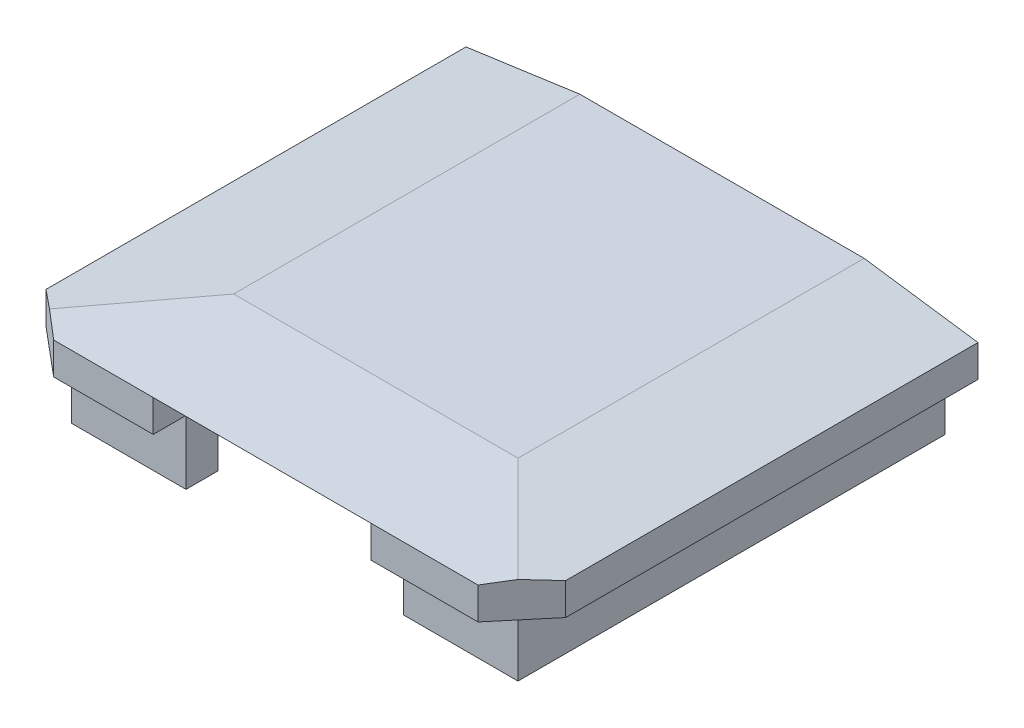
ISO-10303-21;
HEADER;
FILE_DESCRIPTION(('STEP AP214'),'2;1');
FILE_NAME('part.step','',(''),(''),'','','');
FILE_SCHEMA(('AUTOMOTIVE_DESIGN { 1 0 10303 214 1 1 1 1 }'));
ENDSEC;
DATA;
#1=APPLICATION_CONTEXT('core data for automotive mechanical design processes');
#2=APPLICATION_PROTOCOL_DEFINITION('international standard','automotive_design',2000,#1);
#3=PRODUCT_CONTEXT('',#1,'mechanical');
#4=PRODUCT('Part','Part','',(#3));
#5=PRODUCT_RELATED_PRODUCT_CATEGORY('part','',(#4));
#6=PRODUCT_DEFINITION_FORMATION('','',#4);
#7=PRODUCT_DEFINITION_CONTEXT('part definition',#1,'design');
#8=PRODUCT_DEFINITION('design','',#6,#7);
#9=PRODUCT_DEFINITION_SHAPE('','',#8);
#10=(LENGTH_UNIT() NAMED_UNIT(*) SI_UNIT(.MILLI.,.METRE.));
#11=(NAMED_UNIT(*) PLANE_ANGLE_UNIT() SI_UNIT($,.RADIAN.));
#12=(NAMED_UNIT(*) SI_UNIT($,.STERADIAN.) SOLID_ANGLE_UNIT());
#13=UNCERTAINTY_MEASURE_WITH_UNIT(LENGTH_MEASURE(1.E-05),#10,'distance_accuracy_value','');
#14=(GEOMETRIC_REPRESENTATION_CONTEXT(3) GLOBAL_UNCERTAINTY_ASSIGNED_CONTEXT((#13)) GLOBAL_UNIT_ASSIGNED_CONTEXT((#10,
#11,#12)) REPRESENTATION_CONTEXT('',''));
#15=CARTESIAN_POINT('',(0.,0.,0.));
#16=DIRECTION('',(0.,0.,1.));
#17=DIRECTION('',(1.,0.,0.));
#18=AXIS2_PLACEMENT_3D('',#15,#16,#17);
#19=CARTESIAN_POINT('',(0.,0.,0.));
#20=DIRECTION('',(0.,1.,0.));
#21=DIRECTION('',(0.,0.,1.));
#22=AXIS2_PLACEMENT_3D('',#19,#20,#21);
#23=PLANE('',#22);
#24=DIRECTION('',(0.,0.,1.));
#25=VECTOR('',#24,1.);
#26=CARTESIAN_POINT('',(-16.,0.,-24.));
#27=LINE('',#26,#25);
#28=CARTESIAN_POINT('',(-16.,0.,-4.74792761990778));
#29=VERTEX_POINT('',#28);
#30=CARTESIAN_POINT('',(-16.,0.,21.5));
#31=VERTEX_POINT('',#30);
#32=EDGE_CURVE('E279',#29,#31,#27,.T.);
#33=ORIENTED_EDGE('',*,*,#32,.F.);
#34=DIRECTION('',(1.,0.,0.));
#35=VECTOR('',#34,1.);
#36=CARTESIAN_POINT('',(0.,0.,-4.74792761990778));
#37=LINE('',#36,#35);
#38=CARTESIAN_POINT('',(-13.95,0.,-4.74792761990778));
#39=VERTEX_POINT('',#38);
#40=EDGE_CURVE('E407',#29,#39,#37,.T.);
#41=ORIENTED_EDGE('',*,*,#40,.T.);
#42=DIRECTION('',(0.,0.,-1.));
#43=VECTOR('',#42,1.);
#44=CARTESIAN_POINT('',(-13.95,0.,21.95));
#45=LINE('',#44,#43);
#46=CARTESIAN_POINT('',(-13.95,0.,21.95));
#47=VERTEX_POINT('',#46);
#48=EDGE_CURVE('E335',#47,#39,#45,.T.);
#49=ORIENTED_EDGE('',*,*,#48,.F.);
#50=DIRECTION('',(-1.,0.,0.));
#51=VECTOR('',#50,1.);
#52=CARTESIAN_POINT('',(-6.8,0.,21.95));
#53=LINE('',#52,#51);
#54=CARTESIAN_POINT('',(-6.8,0.,21.95));
#55=VERTEX_POINT('',#54);
#56=EDGE_CURVE('E338',#55,#47,#53,.T.);
#57=ORIENTED_EDGE('',*,*,#56,.F.);
#58=DIRECTION('',(0.,0.,1.));
#59=VECTOR('',#58,1.);
#60=CARTESIAN_POINT('',(-6.8,0.,17.));
#61=LINE('',#60,#59);
#62=CARTESIAN_POINT('',(-6.8,0.,24.));
#63=VERTEX_POINT('',#62);
#64=EDGE_CURVE('E275',#55,#63,#61,.T.);
#65=ORIENTED_EDGE('',*,*,#64,.T.);
#66=DIRECTION('',(1.,0.,0.));
#67=VECTOR('',#66,1.);
#68=CARTESIAN_POINT('',(-16.,0.,24.));
#69=LINE('',#68,#67);
#70=CARTESIAN_POINT('',(-13.0206160185145,0.,24.));
#71=VERTEX_POINT('',#70);
#72=EDGE_CURVE('E269',#71,#63,#69,.T.);
#73=ORIENTED_EDGE('',*,*,#72,.F.);
#74=DIRECTION('',(0.766044443118977,0.,0.64278760968654));
#75=VECTOR('',#74,1.);
#76=CARTESIAN_POINT('',(-13.0206160185145,0.,24.));
#77=LINE('',#76,#75);
#78=EDGE_CURVE('E238',#71,#31,#77,.F.);
#79=ORIENTED_EDGE('',*,*,#78,.T.);
#80=EDGE_LOOP('',(#33,#41,#49,#57,#65,#73,#79));
#81=FACE_BOUND('',#80,.T.);
#82=ADVANCED_FACE('F37',(#81),#23,.F.);
#83=DIRECTION('',(0.,0.,1.));
#84=VECTOR('',#83,1.);
#85=CARTESIAN_POINT('',(-11.95,0.,19.95));
#86=LINE('',#85,#84);
#87=CARTESIAN_POINT('',(-11.95,0.,-4.74792761990778));
#88=VERTEX_POINT('',#87);
#89=CARTESIAN_POINT('',(-11.95,0.,19.95));
#90=VERTEX_POINT('',#89);
#91=EDGE_CURVE('E332',#88,#90,#86,.T.);
#92=ORIENTED_EDGE('',*,*,#91,.F.);
#93=CARTESIAN_POINT('',(11.95,0.,-4.74792761990778));
#94=VERTEX_POINT('',#93);
#95=EDGE_CURVE('E398',#88,#94,#37,.T.);
#96=ORIENTED_EDGE('',*,*,#95,.T.);
#97=DIRECTION('',(0.,0.,-1.));
#98=VECTOR('',#97,1.);
#99=CARTESIAN_POINT('',(11.95,0.,-19.95));
#100=LINE('',#99,#98);
#101=CARTESIAN_POINT('',(11.95,0.,19.95));
#102=VERTEX_POINT('',#101);
#103=EDGE_CURVE('E307',#102,#94,#100,.T.);
#104=ORIENTED_EDGE('',*,*,#103,.F.);
#105=DIRECTION('',(1.,0.,0.));
#106=VECTOR('',#105,1.);
#107=CARTESIAN_POINT('',(11.95,0.,19.95));
#108=LINE('',#107,#106);
#109=CARTESIAN_POINT('',(6.8,0.,19.95));
#110=VERTEX_POINT('',#109);
#111=EDGE_CURVE('E298',#110,#102,#108,.T.);
#112=ORIENTED_EDGE('',*,*,#111,.F.);
#113=DIRECTION('',(0.,0.,1.));
#114=VECTOR('',#113,1.);
#115=CARTESIAN_POINT('',(6.8,0.,17.));
#116=LINE('',#115,#114);
#117=CARTESIAN_POINT('',(6.8,0.,17.));
#118=VERTEX_POINT('',#117);
#119=EDGE_CURVE('E358',#118,#110,#116,.T.);
#120=ORIENTED_EDGE('',*,*,#119,.F.);
#121=DIRECTION('',(1.,0.,0.));
#122=VECTOR('',#121,1.);
#123=CARTESIAN_POINT('',(-6.8,0.,17.));
#124=LINE('',#123,#122);
#125=CARTESIAN_POINT('',(-6.8,0.,17.));
#126=VERTEX_POINT('',#125);
#127=EDGE_CURVE('E380',#126,#118,#124,.T.);
#128=ORIENTED_EDGE('',*,*,#127,.F.);
#129=CARTESIAN_POINT('',(-6.8,0.,19.95));
#130=VERTEX_POINT('',#129);
#131=EDGE_CURVE('E355',#126,#130,#61,.T.);
#132=ORIENTED_EDGE('',*,*,#131,.T.);
#133=DIRECTION('',(1.,0.,0.));
#134=VECTOR('',#133,1.);
#135=CARTESIAN_POINT('',(-6.8,0.,19.95));
#136=LINE('',#135,#134);
#137=EDGE_CURVE('E341',#90,#130,#136,.T.);
#138=ORIENTED_EDGE('',*,*,#137,.F.);
#139=EDGE_LOOP('',(#92,#96,#104,#112,#120,#128,#132,#138));
#140=FACE_BOUND('',#139,.T.);
#141=ADVANCED_FACE('F437',(#140),#23,.F.);
#142=CARTESIAN_POINT('',(-16.,3.,24.));
#143=DIRECTION('',(0.,0.,-1.));
#144=DIRECTION('',(-1.,0.,0.));
#145=AXIS2_PLACEMENT_3D('',#142,#143,#144);
#146=PLANE('',#145);
#147=DIRECTION('',(-1.,0.,0.));
#148=VECTOR('',#147,1.);
#149=CARTESIAN_POINT('',(-16.,2.,24.));
#150=LINE('',#149,#148);
#151=CARTESIAN_POINT('',(-6.8,2.,24.));
#152=VERTEX_POINT('',#151);
#153=CARTESIAN_POINT('',(-13.0206160185145,2.,24.));
#154=VERTEX_POINT('',#153);
#155=EDGE_CURVE('E225',#152,#154,#150,.T.);
#156=ORIENTED_EDGE('',*,*,#155,.T.);
#157=DIRECTION('',(0.,-1.,0.));
#158=VECTOR('',#157,1.);
#159=CARTESIAN_POINT('',(-13.0206160185145,3.,24.));
#160=LINE('',#159,#158);
#161=EDGE_CURVE('E252',#154,#71,#160,.T.);
#162=ORIENTED_EDGE('',*,*,#161,.T.);
#163=ORIENTED_EDGE('',*,*,#72,.T.);
#164=DIRECTION('',(0.,-1.,0.));
#165=VECTOR('',#164,1.);
#166=CARTESIAN_POINT('',(-6.8,2.,24.));
#167=LINE('',#166,#165);
#168=EDGE_CURVE('E371',#152,#63,#167,.T.);
#169=ORIENTED_EDGE('',*,*,#168,.F.);
#170=EDGE_LOOP('',(#156,#162,#163,#169));
#171=FACE_BOUND('',#170,.T.);
#172=ADVANCED_FACE('F267',(#171),#146,.F.);
#173=DIRECTION('',(0.,0.,1.));
#174=VECTOR('',#173,1.);
#175=CARTESIAN_POINT('',(13.95,0.,-21.95));
#176=LINE('',#175,#174);
#177=CARTESIAN_POINT('',(13.95,0.,-4.74792761990778));
#178=VERTEX_POINT('',#177);
#179=CARTESIAN_POINT('',(13.95,0.,21.95));
#180=VERTEX_POINT('',#179);
#181=EDGE_CURVE('E305',#178,#180,#176,.T.);
#182=ORIENTED_EDGE('',*,*,#181,.F.);
#183=CARTESIAN_POINT('',(16.,0.,-4.74792761990778));
#184=VERTEX_POINT('',#183);
#185=EDGE_CURVE('E389',#178,#184,#37,.T.);
#186=ORIENTED_EDGE('',*,*,#185,.T.);
#187=DIRECTION('',(0.,0.,-1.));
#188=VECTOR('',#187,1.);
#189=CARTESIAN_POINT('',(16.,0.,-24.));
#190=LINE('',#189,#188);
#191=CARTESIAN_POINT('',(16.,0.,21.0206160185145));
#192=VERTEX_POINT('',#191);
#193=EDGE_CURVE('E282',#192,#184,#190,.T.);
#194=ORIENTED_EDGE('',*,*,#193,.F.);
#195=DIRECTION('',(0.642787609686541,0.,-0.766044443118977));
#196=VECTOR('',#195,1.);
#197=CARTESIAN_POINT('',(16.,0.,21.0206160185145));
#198=LINE('',#197,#196);
#199=CARTESIAN_POINT('',(13.5,0.,24.));
#200=VERTEX_POINT('',#199);
#201=EDGE_CURVE('E241',#192,#200,#198,.F.);
#202=ORIENTED_EDGE('',*,*,#201,.T.);
#203=CARTESIAN_POINT('',(6.8,0.,24.));
#204=VERTEX_POINT('',#203);
#205=EDGE_CURVE('E276',#204,#200,#69,.T.);
#206=ORIENTED_EDGE('',*,*,#205,.F.);
#207=CARTESIAN_POINT('',(6.8,0.,21.95));
#208=VERTEX_POINT('',#207);
#209=EDGE_CURVE('E357',#208,#204,#116,.T.);
#210=ORIENTED_EDGE('',*,*,#209,.F.);
#211=DIRECTION('',(-1.,0.,0.));
#212=VECTOR('',#211,1.);
#213=CARTESIAN_POINT('',(13.95,0.,21.95));
#214=LINE('',#213,#212);
#215=EDGE_CURVE('E302',#180,#208,#214,.T.);
#216=ORIENTED_EDGE('',*,*,#215,.F.);
#217=EDGE_LOOP('',(#182,#186,#194,#202,#206,#210,#216));
#218=FACE_BOUND('',#217,.T.);
#219=ADVANCED_FACE('F461',(#218),#23,.F.);
#220=CARTESIAN_POINT('',(16.,3.,-24.));
#221=DIRECTION('',(-1.,0.,0.));
#222=DIRECTION('',(0.,0.,1.));
#223=AXIS2_PLACEMENT_3D('',#220,#221,#222);
#224=PLANE('',#223);
#225=ORIENTED_EDGE('',*,*,#193,.T.);
#226=DIRECTION('',(0.,1.,0.));
#227=VECTOR('',#226,1.);
#228=CARTESIAN_POINT('',(16.,3.,-4.74792761990778));
#229=LINE('',#228,#227);
#230=CARTESIAN_POINT('',(16.,2.,-4.74792761990778));
#231=VERTEX_POINT('',#230);
#232=EDGE_CURVE('E386',#184,#231,#229,.T.);
#233=ORIENTED_EDGE('',*,*,#232,.T.);
#234=DIRECTION('',(0.,0.,1.));
#235=VECTOR('',#234,1.);
#236=CARTESIAN_POINT('',(16.,2.,16.8846302776158));
#237=LINE('',#236,#235);
#238=CARTESIAN_POINT('',(16.,2.,21.0206160185145));
#239=VERTEX_POINT('',#238);
#240=EDGE_CURVE('E223',#231,#239,#237,.T.);
#241=ORIENTED_EDGE('',*,*,#240,.T.);
#242=DIRECTION('',(0.,-1.,0.));
#243=VECTOR('',#242,1.);
#244=CARTESIAN_POINT('',(16.,3.,21.0206160185145));
#245=LINE('',#244,#243);
#246=EDGE_CURVE('E235',#239,#192,#245,.T.);
#247=ORIENTED_EDGE('',*,*,#246,.T.);
#248=EDGE_LOOP('',(#225,#233,#241,#247));
#249=FACE_BOUND('',#248,.T.);
#250=ADVANCED_FACE('F469',(#249),#224,.F.);
#251=CARTESIAN_POINT('',(-16.,3.,-24.));
#252=DIRECTION('',(1.,0.,0.));
#253=DIRECTION('',(0.,0.,-1.));
#254=AXIS2_PLACEMENT_3D('',#251,#252,#253);
#255=PLANE('',#254);
#256=DIRECTION('',(0.,0.,-1.));
#257=VECTOR('',#256,1.);
#258=CARTESIAN_POINT('',(-16.,2.,-16.8846302776158));
#259=LINE('',#258,#257);
#260=CARTESIAN_POINT('',(-16.,2.,21.5));
#261=VERTEX_POINT('',#260);
#262=CARTESIAN_POINT('',(-16.,2.,-4.74792761990778));
#263=VERTEX_POINT('',#262);
#264=EDGE_CURVE('E233',#261,#263,#259,.T.);
#265=ORIENTED_EDGE('',*,*,#264,.T.);
#266=DIRECTION('',(0.,-1.,0.));
#267=VECTOR('',#266,1.);
#268=CARTESIAN_POINT('',(-16.,3.,-4.74792761990778));
#269=LINE('',#268,#267);
#270=EDGE_CURVE('E52',#263,#29,#269,.T.);
#271=ORIENTED_EDGE('',*,*,#270,.T.);
#272=ORIENTED_EDGE('',*,*,#32,.T.);
#273=DIRECTION('',(0.,1.,0.));
#274=VECTOR('',#273,1.);
#275=CARTESIAN_POINT('',(-16.,3.,21.5));
#276=LINE('',#275,#274);
#277=EDGE_CURVE('E60',#31,#261,#276,.T.);
#278=ORIENTED_EDGE('',*,*,#277,.T.);
#279=EDGE_LOOP('',(#265,#271,#272,#278));
#280=FACE_BOUND('',#279,.T.);
#281=ADVANCED_FACE('F410',(#280),#255,.F.);
#282=ORIENTED_EDGE('',*,*,#205,.T.);
#283=DIRECTION('',(0.,1.,0.));
#284=VECTOR('',#283,1.);
#285=CARTESIAN_POINT('',(13.5,3.,24.));
#286=LINE('',#285,#284);
#287=CARTESIAN_POINT('',(13.5,2.,24.));
#288=VERTEX_POINT('',#287);
#289=EDGE_CURVE('E243',#200,#288,#286,.T.);
#290=ORIENTED_EDGE('',*,*,#289,.T.);
#291=CARTESIAN_POINT('',(6.8,2.,24.));
#292=VERTEX_POINT('',#291);
#293=EDGE_CURVE('E221',#288,#292,#150,.T.);
#294=ORIENTED_EDGE('',*,*,#293,.T.);
#295=DIRECTION('',(0.,1.,0.));
#296=VECTOR('',#295,1.);
#297=CARTESIAN_POINT('',(6.8,0.,24.));
#298=LINE('',#297,#296);
#299=EDGE_CURVE('E368',#204,#292,#298,.T.);
#300=ORIENTED_EDGE('',*,*,#299,.F.);
#301=EDGE_LOOP('',(#282,#290,#294,#300));
#302=FACE_BOUND('',#301,.T.);
#303=ADVANCED_FACE('F458',(#302),#146,.F.);
#304=CARTESIAN_POINT('',(0.,3.,0.));
#305=DIRECTION('',(0.,1.,0.));
#306=DIRECTION('',(0.,0.,1.));
#307=AXIS2_PLACEMENT_3D('',#304,#305,#306);
#308=PLANE('',#307);
#309=DIRECTION('',(1.,0.,0.));
#310=VECTOR('',#309,1.);
#311=CARTESIAN_POINT('',(-21.6753217430571,3.,-4.74792761990778));
#312=LINE('',#311,#310);
#313=CARTESIAN_POINT('',(-8.88463027761579,3.,-4.74792761990778));
#314=VERTEX_POINT('',#313);
#315=CARTESIAN_POINT('',(8.88463027761578,3.,-4.74792761990778));
#316=VERTEX_POINT('',#315);
#317=EDGE_CURVE('E204',#314,#316,#312,.T.);
#318=ORIENTED_EDGE('',*,*,#317,.F.);
#319=DIRECTION('',(0.,0.,1.));
#320=VECTOR('',#319,1.);
#321=CARTESIAN_POINT('',(-8.88463027761579,3.,16.8846302776158));
#322=LINE('',#321,#320);
#323=CARTESIAN_POINT('',(-8.88463027761579,3.,16.8846302776158));
#324=VERTEX_POINT('',#323);
#325=EDGE_CURVE('E212',#314,#324,#322,.T.);
#326=ORIENTED_EDGE('',*,*,#325,.T.);
#327=DIRECTION('',(1.,0.,0.));
#328=VECTOR('',#327,1.);
#329=CARTESIAN_POINT('',(16.,3.,16.8846302776158));
#330=LINE('',#329,#328);
#331=CARTESIAN_POINT('',(8.88463027761578,3.,16.8846302776158));
#332=VERTEX_POINT('',#331);
#333=EDGE_CURVE('E263',#324,#332,#330,.T.);
#334=ORIENTED_EDGE('',*,*,#333,.T.);
#335=DIRECTION('',(0.,0.,-1.));
#336=VECTOR('',#335,1.);
#337=CARTESIAN_POINT('',(8.88463027761578,3.,-16.8846302776158));
#338=LINE('',#337,#336);
#339=EDGE_CURVE('E215',#332,#316,#338,.T.);
#340=ORIENTED_EDGE('',*,*,#339,.T.);
#341=EDGE_LOOP('',(#318,#326,#334,#340));
#342=FACE_BOUND('',#341,.T.);
#343=ADVANCED_FACE('F210',(#342),#308,.T.);
#344=CARTESIAN_POINT('',(11.95,-4.,-19.95));
#345=DIRECTION('',(1.,0.,0.));
#346=DIRECTION('',(0.,0.,-1.));
#347=AXIS2_PLACEMENT_3D('',#344,#345,#346);
#348=PLANE('',#347);
#349=ORIENTED_EDGE('',*,*,#103,.T.);
#350=DIRECTION('',(0.,-1.,0.));
#351=VECTOR('',#350,1.);
#352=CARTESIAN_POINT('',(11.95,-4.,-4.74792761990778));
#353=LINE('',#352,#351);
#354=CARTESIAN_POINT('',(11.95,-4.,-4.74792761990778));
#355=VERTEX_POINT('',#354);
#356=EDGE_CURVE('E395',#94,#355,#353,.T.);
#357=ORIENTED_EDGE('',*,*,#356,.T.);
#358=DIRECTION('',(0.,0.,-1.));
#359=VECTOR('',#358,1.);
#360=CARTESIAN_POINT('',(11.95,-4.,-19.95));
#361=LINE('',#360,#359);
#362=CARTESIAN_POINT('',(11.95,-4.,19.95));
#363=VERTEX_POINT('',#362);
#364=EDGE_CURVE('E301',#363,#355,#361,.T.);
#365=ORIENTED_EDGE('',*,*,#364,.F.);
#366=DIRECTION('',(0.,1.,0.));
#367=VECTOR('',#366,1.);
#368=CARTESIAN_POINT('',(11.95,-4.,19.95));
#369=LINE('',#368,#367);
#370=EDGE_CURVE('E294',#363,#102,#369,.T.);
#371=ORIENTED_EDGE('',*,*,#370,.T.);
#372=EDGE_LOOP('',(#349,#357,#365,#371));
#373=FACE_BOUND('',#372,.T.);
#374=ADVANCED_FACE('F477',(#373),#348,.F.);
#375=CARTESIAN_POINT('',(13.95,-4.,-21.95));
#376=DIRECTION('',(-1.,0.,0.));
#377=DIRECTION('',(0.,0.,1.));
#378=AXIS2_PLACEMENT_3D('',#375,#376,#377);
#379=PLANE('',#378);
#380=DIRECTION('',(0.,0.,1.));
#381=VECTOR('',#380,1.);
#382=CARTESIAN_POINT('',(13.95,-4.,-21.95));
#383=LINE('',#382,#381);
#384=CARTESIAN_POINT('',(13.95,-4.,-4.74792761990778));
#385=VERTEX_POINT('',#384);
#386=CARTESIAN_POINT('',(13.95,-4.,21.95));
#387=VERTEX_POINT('',#386);
#388=EDGE_CURVE('E316',#385,#387,#383,.T.);
#389=ORIENTED_EDGE('',*,*,#388,.F.);
#390=DIRECTION('',(0.,1.,0.));
#391=VECTOR('',#390,1.);
#392=CARTESIAN_POINT('',(13.95,-4.,-4.74792761990778));
#393=LINE('',#392,#391);
#394=EDGE_CURVE('E390',#385,#178,#393,.T.);
#395=ORIENTED_EDGE('',*,*,#394,.T.);
#396=ORIENTED_EDGE('',*,*,#181,.T.);
#397=DIRECTION('',(0.,1.,0.));
#398=VECTOR('',#397,1.);
#399=CARTESIAN_POINT('',(13.95,-4.,21.95));
#400=LINE('',#399,#398);
#401=EDGE_CURVE('E285',#387,#180,#400,.T.);
#402=ORIENTED_EDGE('',*,*,#401,.F.);
#403=EDGE_LOOP('',(#389,#395,#396,#402));
#404=FACE_BOUND('',#403,.T.);
#405=ADVANCED_FACE('F479',(#404),#379,.F.);
#406=CARTESIAN_POINT('',(13.95,-4.,21.95));
#407=DIRECTION('',(0.,0.,-1.));
#408=DIRECTION('',(-1.,0.,0.));
#409=AXIS2_PLACEMENT_3D('',#406,#407,#408);
#410=PLANE('',#409);
#411=ORIENTED_EDGE('',*,*,#215,.T.);
#412=DIRECTION('',(0.,1.,0.));
#413=VECTOR('',#412,1.);
#414=CARTESIAN_POINT('',(6.8,-4.,21.95));
#415=LINE('',#414,#413);
#416=CARTESIAN_POINT('',(6.8,-4.,21.95));
#417=VERTEX_POINT('',#416);
#418=EDGE_CURVE('E288',#417,#208,#415,.T.);
#419=ORIENTED_EDGE('',*,*,#418,.F.);
#420=DIRECTION('',(-1.,0.,0.));
#421=VECTOR('',#420,1.);
#422=CARTESIAN_POINT('',(13.95,-4.,21.95));
#423=LINE('',#422,#421);
#424=EDGE_CURVE('E314',#387,#417,#423,.T.);
#425=ORIENTED_EDGE('',*,*,#424,.F.);
#426=ORIENTED_EDGE('',*,*,#401,.T.);
#427=EDGE_LOOP('',(#411,#419,#425,#426));
#428=FACE_BOUND('',#427,.T.);
#429=ADVANCED_FACE('F453',(#428),#410,.F.);
#430=CARTESIAN_POINT('',(6.8,-4.,21.95));
#431=DIRECTION('',(1.,0.,0.));
#432=DIRECTION('',(0.,0.,-1.));
#433=AXIS2_PLACEMENT_3D('',#430,#431,#432);
#434=PLANE('',#433);
#435=ORIENTED_EDGE('',*,*,#418,.T.);
#436=ORIENTED_EDGE('',*,*,#209,.T.);
#437=ORIENTED_EDGE('',*,*,#299,.T.);
#438=DIRECTION('',(0.,0.,1.));
#439=VECTOR('',#438,1.);
#440=CARTESIAN_POINT('',(6.8,2.,17.));
#441=LINE('',#440,#439);
#442=CARTESIAN_POINT('',(6.8,2.,17.));
#443=VERTEX_POINT('',#442);
#444=EDGE_CURVE('E360',#443,#292,#441,.T.);
#445=ORIENTED_EDGE('',*,*,#444,.F.);
#446=DIRECTION('',(0.,1.,0.));
#447=VECTOR('',#446,1.);
#448=CARTESIAN_POINT('',(6.8,0.,17.));
#449=LINE('',#448,#447);
#450=EDGE_CURVE('E377',#118,#443,#449,.T.);
#451=ORIENTED_EDGE('',*,*,#450,.F.);
#452=ORIENTED_EDGE('',*,*,#119,.T.);
#453=DIRECTION('',(0.,1.,0.));
#454=VECTOR('',#453,1.);
#455=CARTESIAN_POINT('',(6.8,-4.,19.95));
#456=LINE('',#455,#454);
#457=CARTESIAN_POINT('',(6.8,-4.,19.95));
#458=VERTEX_POINT('',#457);
#459=EDGE_CURVE('E291',#458,#110,#456,.T.);
#460=ORIENTED_EDGE('',*,*,#459,.F.);
#461=DIRECTION('',(0.,0.,-1.));
#462=VECTOR('',#461,1.);
#463=CARTESIAN_POINT('',(6.8,-4.,21.95));
#464=LINE('',#463,#462);
#465=EDGE_CURVE('E312',#417,#458,#464,.T.);
#466=ORIENTED_EDGE('',*,*,#465,.F.);
#467=EDGE_LOOP('',(#435,#436,#437,#445,#451,#452,#460,#466));
#468=FACE_BOUND('',#467,.T.);
#469=ADVANCED_FACE('F428',(#468),#434,.F.);
#470=CARTESIAN_POINT('',(11.95,-4.,19.95));
#471=DIRECTION('',(0.,0.,1.));
#472=DIRECTION('',(1.,0.,0.));
#473=AXIS2_PLACEMENT_3D('',#470,#471,#472);
#474=PLANE('',#473);
#475=ORIENTED_EDGE('',*,*,#111,.T.);
#476=ORIENTED_EDGE('',*,*,#370,.F.);
#477=DIRECTION('',(1.,0.,0.));
#478=VECTOR('',#477,1.);
#479=CARTESIAN_POINT('',(11.95,-4.,19.95));
#480=LINE('',#479,#478);
#481=EDGE_CURVE('E297',#458,#363,#480,.T.);
#482=ORIENTED_EDGE('',*,*,#481,.F.);
#483=ORIENTED_EDGE('',*,*,#459,.T.);
#484=EDGE_LOOP('',(#475,#476,#482,#483));
#485=FACE_BOUND('',#484,.T.);
#486=ADVANCED_FACE('F443',(#485),#474,.F.);
#487=CARTESIAN_POINT('',(0.,-4.,0.));
#488=DIRECTION('',(0.,-1.,0.));
#489=DIRECTION('',(0.,0.,-1.));
#490=AXIS2_PLACEMENT_3D('',#487,#488,#489);
#491=PLANE('',#490);
#492=DIRECTION('',(-1.,0.,0.));
#493=VECTOR('',#492,1.);
#494=CARTESIAN_POINT('',(0.,-4.,-4.74792761990778));
#495=LINE('',#494,#493);
#496=EDGE_CURVE('E393',#385,#355,#495,.T.);
#497=ORIENTED_EDGE('',*,*,#496,.F.);
#498=ORIENTED_EDGE('',*,*,#388,.T.);
#499=ORIENTED_EDGE('',*,*,#424,.T.);
#500=ORIENTED_EDGE('',*,*,#465,.T.);
#501=ORIENTED_EDGE('',*,*,#481,.T.);
#502=ORIENTED_EDGE('',*,*,#364,.T.);
#503=EDGE_LOOP('',(#497,#498,#499,#500,#501,#502));
#504=FACE_BOUND('',#503,.T.);
#505=ADVANCED_FACE('F447',(#504),#491,.T.);
#506=CARTESIAN_POINT('',(-6.8,-4.,19.95));
#507=DIRECTION('',(0.,0.,1.));
#508=DIRECTION('',(1.,0.,0.));
#509=AXIS2_PLACEMENT_3D('',#506,#507,#508);
#510=PLANE('',#509);
#511=ORIENTED_EDGE('',*,*,#137,.T.);
#512=DIRECTION('',(0.,1.,0.));
#513=VECTOR('',#512,1.);
#514=CARTESIAN_POINT('',(-6.8,-4.,19.95));
#515=LINE('',#514,#513);
#516=CARTESIAN_POINT('',(-6.8,-4.,19.95));
#517=VERTEX_POINT('',#516);
#518=EDGE_CURVE('E310',#517,#130,#515,.T.);
#519=ORIENTED_EDGE('',*,*,#518,.F.);
#520=DIRECTION('',(1.,0.,0.));
#521=VECTOR('',#520,1.);
#522=CARTESIAN_POINT('',(-6.8,-4.,19.95));
#523=LINE('',#522,#521);
#524=CARTESIAN_POINT('',(-11.95,-4.,19.95));
#525=VERTEX_POINT('',#524);
#526=EDGE_CURVE('E334',#525,#517,#523,.T.);
#527=ORIENTED_EDGE('',*,*,#526,.F.);
#528=DIRECTION('',(0.,1.,0.));
#529=VECTOR('',#528,1.);
#530=CARTESIAN_POINT('',(-11.95,-4.,19.95));
#531=LINE('',#530,#529);
#532=EDGE_CURVE('E328',#525,#90,#531,.T.);
#533=ORIENTED_EDGE('',*,*,#532,.T.);
#534=EDGE_LOOP('',(#511,#519,#527,#533));
#535=FACE_BOUND('',#534,.T.);
#536=ADVANCED_FACE('F558',(#535),#510,.F.);
#537=CARTESIAN_POINT('',(-6.8,-4.,21.95));
#538=DIRECTION('',(-1.,0.,0.));
#539=DIRECTION('',(0.,0.,1.));
#540=AXIS2_PLACEMENT_3D('',#537,#538,#539);
#541=PLANE('',#540);
#542=ORIENTED_EDGE('',*,*,#518,.T.);
#543=ORIENTED_EDGE('',*,*,#131,.F.);
#544=DIRECTION('',(0.,-1.,0.));
#545=VECTOR('',#544,1.);
#546=CARTESIAN_POINT('',(-6.8,2.,17.));
#547=LINE('',#546,#545);
#548=CARTESIAN_POINT('',(-6.8,2.,17.));
#549=VERTEX_POINT('',#548);
#550=EDGE_CURVE('E367',#549,#126,#547,.T.);
#551=ORIENTED_EDGE('',*,*,#550,.F.);
#552=DIRECTION('',(0.,0.,1.));
#553=VECTOR('',#552,1.);
#554=CARTESIAN_POINT('',(-6.8,2.,17.));
#555=LINE('',#554,#553);
#556=EDGE_CURVE('E344',#549,#152,#555,.T.);
#557=ORIENTED_EDGE('',*,*,#556,.T.);
#558=ORIENTED_EDGE('',*,*,#168,.T.);
#559=ORIENTED_EDGE('',*,*,#64,.F.);
#560=DIRECTION('',(0.,1.,0.));
#561=VECTOR('',#560,1.);
#562=CARTESIAN_POINT('',(-6.8,-4.,21.95));
#563=LINE('',#562,#561);
#564=CARTESIAN_POINT('',(-6.8,-4.,21.95));
#565=VERTEX_POINT('',#564);
#566=EDGE_CURVE('E322',#565,#55,#563,.T.);
#567=ORIENTED_EDGE('',*,*,#566,.F.);
#568=DIRECTION('',(0.,0.,1.));
#569=VECTOR('',#568,1.);
#570=CARTESIAN_POINT('',(-6.8,-4.,21.95));
#571=LINE('',#570,#569);
#572=EDGE_CURVE('E351',#517,#565,#571,.T.);
#573=ORIENTED_EDGE('',*,*,#572,.F.);
#574=EDGE_LOOP('',(#542,#543,#551,#557,#558,#559,#567,#573));
#575=FACE_BOUND('',#574,.T.);
#576=ADVANCED_FACE('F420',(#575),#541,.F.);
#577=CARTESIAN_POINT('',(-6.8,-4.,21.95));
#578=DIRECTION('',(0.,0.,-1.));
#579=DIRECTION('',(-1.,0.,0.));
#580=AXIS2_PLACEMENT_3D('',#577,#578,#579);
#581=PLANE('',#580);
#582=ORIENTED_EDGE('',*,*,#56,.T.);
#583=DIRECTION('',(0.,1.,0.));
#584=VECTOR('',#583,1.);
#585=CARTESIAN_POINT('',(-13.95,-4.,21.95));
#586=LINE('',#585,#584);
#587=CARTESIAN_POINT('',(-13.95,-4.,21.95));
#588=VERTEX_POINT('',#587);
#589=EDGE_CURVE('E325',#588,#47,#586,.T.);
#590=ORIENTED_EDGE('',*,*,#589,.F.);
#591=DIRECTION('',(-1.,0.,0.));
#592=VECTOR('',#591,1.);
#593=CARTESIAN_POINT('',(-6.8,-4.,21.95));
#594=LINE('',#593,#592);
#595=EDGE_CURVE('E349',#565,#588,#594,.T.);
#596=ORIENTED_EDGE('',*,*,#595,.F.);
#597=ORIENTED_EDGE('',*,*,#566,.T.);
#598=EDGE_LOOP('',(#582,#590,#596,#597));
#599=FACE_BOUND('',#598,.T.);
#600=ADVANCED_FACE('F417',(#599),#581,.F.);
#601=CARTESIAN_POINT('',(-13.95,-4.,21.95));
#602=DIRECTION('',(1.,0.,0.));
#603=DIRECTION('',(0.,0.,-1.));
#604=AXIS2_PLACEMENT_3D('',#601,#602,#603);
#605=PLANE('',#604);
#606=ORIENTED_EDGE('',*,*,#48,.T.);
#607=DIRECTION('',(0.,-1.,0.));
#608=VECTOR('',#607,1.);
#609=CARTESIAN_POINT('',(-13.95,-4.,-4.74792761990778));
#610=LINE('',#609,#608);
#611=CARTESIAN_POINT('',(-13.95,-4.,-4.74792761990778));
#612=VERTEX_POINT('',#611);
#613=EDGE_CURVE('E404',#39,#612,#610,.T.);
#614=ORIENTED_EDGE('',*,*,#613,.T.);
#615=DIRECTION('',(0.,0.,-1.));
#616=VECTOR('',#615,1.);
#617=CARTESIAN_POINT('',(-13.95,-4.,21.95));
#618=LINE('',#617,#616);
#619=EDGE_CURVE('E346',#588,#612,#618,.T.);
#620=ORIENTED_EDGE('',*,*,#619,.F.);
#621=ORIENTED_EDGE('',*,*,#589,.T.);
#622=EDGE_LOOP('',(#606,#614,#620,#621));
#623=FACE_BOUND('',#622,.T.);
#624=ADVANCED_FACE('F412',(#623),#605,.F.);
#625=CARTESIAN_POINT('',(-11.95,-4.,19.95));
#626=DIRECTION('',(-1.,0.,0.));
#627=DIRECTION('',(0.,0.,1.));
#628=AXIS2_PLACEMENT_3D('',#625,#626,#627);
#629=PLANE('',#628);
#630=DIRECTION('',(0.,0.,1.));
#631=VECTOR('',#630,1.);
#632=CARTESIAN_POINT('',(-11.95,-4.,-21.95));
#633=LINE('',#632,#631);
#634=CARTESIAN_POINT('',(-11.95,-4.,-4.74792761990778));
#635=VERTEX_POINT('',#634);
#636=EDGE_CURVE('E331',#635,#525,#633,.T.);
#637=ORIENTED_EDGE('',*,*,#636,.F.);
#638=DIRECTION('',(0.,1.,0.));
#639=VECTOR('',#638,1.);
#640=CARTESIAN_POINT('',(-11.95,-4.,-4.74792761990778));
#641=LINE('',#640,#639);
#642=EDGE_CURVE('E399',#635,#88,#641,.T.);
#643=ORIENTED_EDGE('',*,*,#642,.T.);
#644=ORIENTED_EDGE('',*,*,#91,.T.);
#645=ORIENTED_EDGE('',*,*,#532,.F.);
#646=EDGE_LOOP('',(#637,#643,#644,#645));
#647=FACE_BOUND('',#646,.T.);
#648=ADVANCED_FACE('F547',(#647),#629,.F.);
#649=CARTESIAN_POINT('',(0.,-4.,0.));
#650=DIRECTION('',(0.,-1.,0.));
#651=DIRECTION('',(0.,0.,-1.));
#652=AXIS2_PLACEMENT_3D('',#649,#650,#651);
#653=PLANE('',#652);
#654=DIRECTION('',(-1.,0.,0.));
#655=VECTOR('',#654,1.);
#656=CARTESIAN_POINT('',(0.,-4.,-4.74792761990778));
#657=LINE('',#656,#655);
#658=EDGE_CURVE('E402',#635,#612,#657,.T.);
#659=ORIENTED_EDGE('',*,*,#658,.F.);
#660=ORIENTED_EDGE('',*,*,#636,.T.);
#661=ORIENTED_EDGE('',*,*,#526,.T.);
#662=ORIENTED_EDGE('',*,*,#572,.T.);
#663=ORIENTED_EDGE('',*,*,#595,.T.);
#664=ORIENTED_EDGE('',*,*,#619,.T.);
#665=EDGE_LOOP('',(#659,#660,#661,#662,#663,#664));
#666=FACE_BOUND('',#665,.T.);
#667=ADVANCED_FACE('F521',(#666),#653,.T.);
#668=CARTESIAN_POINT('',(0.,3.,16.8846302776158));
#669=DIRECTION('',(0.,0.99026806874157,0.139173100960066));
#670=DIRECTION('',(-1.,0.,0.));
#671=AXIS2_PLACEMENT_3D('',#668,#669,#670);
#672=PLANE('',#671);
#673=ORIENTED_EDGE('',*,*,#293,.F.);
#674=DIRECTION('',(-0.639094475910372,-0.107041962313954,0.761643137673297));
#675=VECTOR('',#674,1.);
#676=CARTESIAN_POINT('',(11.5179373545383,1.66802423898722,26.3621302784758));
#677=LINE('',#676,#675);
#678=CARTESIAN_POINT('',(14.6406391705926,2.19104570562665,22.6406391705926));
#679=VERTEX_POINT('',#678);
#680=EDGE_CURVE('E247',#288,#679,#677,.F.);
#681=ORIENTED_EDGE('',*,*,#680,.T.);
#682=DIRECTION('',(-0.703640787534026,0.0988902636106803,-0.703640787534026));
#683=VECTOR('',#682,1.);
#684=CARTESIAN_POINT('',(4.48575780122058,3.61822120958196,12.4857578012206));
#685=LINE('',#684,#683);
#686=EDGE_CURVE('E231',#679,#332,#685,.T.);
#687=ORIENTED_EDGE('',*,*,#686,.T.);
#688=ORIENTED_EDGE('',*,*,#333,.F.);
#689=DIRECTION('',(-0.703640787534027,-0.0988902636106803,0.703640787534026));
#690=VECTOR('',#689,1.);
#691=CARTESIAN_POINT('',(-4.48575780122058,3.61822120958196,12.4857578012206));
#692=LINE('',#691,#690);
#693=CARTESIAN_POINT('',(-14.6406391705926,2.19104570562665,22.6406391705926));
#694=VERTEX_POINT('',#693);
#695=EDGE_CURVE('E219',#324,#694,#692,.T.);
#696=ORIENTED_EDGE('',*,*,#695,.T.);
#697=DIRECTION('',(-0.762937625743273,0.0899715271798894,-0.640180680372452));
#698=VECTOR('',#697,1.);
#699=CARTESIAN_POINT('',(-8.98557310621695,1.52415641750252,27.3858030194934));
#700=LINE('',#699,#698);
#701=EDGE_CURVE('E245',#694,#154,#700,.F.);
#702=ORIENTED_EDGE('',*,*,#701,.T.);
#703=ORIENTED_EDGE('',*,*,#155,.F.);
#704=DIRECTION('',(-1.,0.,0.));
#705=VECTOR('',#704,1.);
#706=CARTESIAN_POINT('',(6.8,2.,24.));
#707=LINE('',#706,#705);
#708=EDGE_CURVE('E364',#292,#152,#707,.T.);
#709=ORIENTED_EDGE('',*,*,#708,.F.);
#710=EDGE_LOOP('',(#673,#681,#687,#688,#696,#702,#703,#709));
#711=FACE_BOUND('',#710,.T.);
#712=ADVANCED_FACE('F260',(#711),#672,.T.);
#713=CARTESIAN_POINT('',(8.88463027761578,3.,0.));
#714=DIRECTION('',(0.139173100960066,0.99026806874157,0.));
#715=DIRECTION('',(0.,0.,1.));
#716=AXIS2_PLACEMENT_3D('',#713,#714,#715);
#717=PLANE('',#716);
#718=DIRECTION('',(0.99026806874157,-0.139173100960066,0.));
#719=VECTOR('',#718,1.);
#720=CARTESIAN_POINT('',(8.88463027761578,3.,-4.74792761990778));
#721=LINE('',#720,#719);
#722=EDGE_CURVE('E373',#316,#231,#721,.T.);
#723=ORIENTED_EDGE('',*,*,#722,.F.);
#724=ORIENTED_EDGE('',*,*,#339,.F.);
#725=ORIENTED_EDGE('',*,*,#686,.F.);
#726=DIRECTION('',(-0.640180680372452,0.0899715271798895,0.762937625743273));
#727=VECTOR('',#726,1.);
#728=CARTESIAN_POINT('',(23.2931464461339,0.975015110853554,12.3289825400187));
#729=LINE('',#728,#727);
#730=EDGE_CURVE('E249',#679,#239,#729,.F.);
#731=ORIENTED_EDGE('',*,*,#730,.T.);
#732=ORIENTED_EDGE('',*,*,#240,.F.);
#733=EDGE_LOOP('',(#723,#724,#725,#731,#732));
#734=FACE_BOUND('',#733,.T.);
#735=ADVANCED_FACE('F473',(#734),#717,.T.);
#736=CARTESIAN_POINT('',(-8.88463027761579,3.,0.));
#737=DIRECTION('',(-0.139173100960066,0.99026806874157,0.));
#738=DIRECTION('',(0.,0.,-1.));
#739=AXIS2_PLACEMENT_3D('',#736,#737,#738);
#740=PLANE('',#739);
#741=DIRECTION('',(0.99026806874157,0.139173100960066,0.));
#742=VECTOR('',#741,1.);
#743=CARTESIAN_POINT('',(-8.88463027761579,3.,-4.74792761990778));
#744=LINE('',#743,#742);
#745=EDGE_CURVE('E11',#263,#314,#744,.T.);
#746=ORIENTED_EDGE('',*,*,#745,.F.);
#747=ORIENTED_EDGE('',*,*,#264,.F.);
#748=DIRECTION('',(-0.761643137673297,-0.107041962313954,-0.639094475910372));
#749=VECTOR('',#748,1.);
#750=CARTESIAN_POINT('',(-22.2562256536922,1.12074482454359,16.250403361425));
#751=LINE('',#750,#749);
#752=EDGE_CURVE('E46',#261,#694,#751,.F.);
#753=ORIENTED_EDGE('',*,*,#752,.T.);
#754=ORIENTED_EDGE('',*,*,#695,.F.);
#755=ORIENTED_EDGE('',*,*,#325,.F.);
#756=EDGE_LOOP('',(#746,#747,#753,#754,#755));
#757=FACE_BOUND('',#756,.T.);
#758=ADVANCED_FACE('F217',(#757),#740,.T.);
#759=CARTESIAN_POINT('',(6.8,2.,17.));
#760=DIRECTION('',(0.,1.,0.));
#761=DIRECTION('',(-1.,0.,0.));
#762=AXIS2_PLACEMENT_3D('',#759,#760,#761);
#763=PLANE('',#762);
#764=ORIENTED_EDGE('',*,*,#708,.T.);
#765=ORIENTED_EDGE('',*,*,#556,.F.);
#766=DIRECTION('',(-1.,0.,0.));
#767=VECTOR('',#766,1.);
#768=CARTESIAN_POINT('',(6.8,2.,17.));
#769=LINE('',#768,#767);
#770=EDGE_CURVE('E374',#443,#549,#769,.T.);
#771=ORIENTED_EDGE('',*,*,#770,.F.);
#772=ORIENTED_EDGE('',*,*,#444,.T.);
#773=EDGE_LOOP('',(#764,#765,#771,#772));
#774=FACE_BOUND('',#773,.T.);
#775=ADVANCED_FACE('F425',(#774),#763,.F.);
#776=CARTESIAN_POINT('',(0.,0.,17.));
#777=DIRECTION('',(0.,0.,1.));
#778=DIRECTION('',(1.,0.,0.));
#779=AXIS2_PLACEMENT_3D('',#776,#777,#778);
#780=PLANE('',#779);
#781=ORIENTED_EDGE('',*,*,#550,.T.);
#782=ORIENTED_EDGE('',*,*,#127,.T.);
#783=ORIENTED_EDGE('',*,*,#450,.T.);
#784=ORIENTED_EDGE('',*,*,#770,.T.);
#785=EDGE_LOOP('',(#781,#782,#783,#784));
#786=FACE_BOUND('',#785,.T.);
#787=ADVANCED_FACE('F431',(#786),#780,.T.);
#788=CARTESIAN_POINT('',(16.,3.,21.0206160185145));
#789=DIRECTION('',(-0.766044443118977,0.,-0.642787609686541));
#790=DIRECTION('',(0.,-1.,0.));
#791=AXIS2_PLACEMENT_3D('',#788,#789,#790);
#792=PLANE('',#791);
#793=ORIENTED_EDGE('',*,*,#680,.F.);
#794=ORIENTED_EDGE('',*,*,#289,.F.);
#795=ORIENTED_EDGE('',*,*,#201,.F.);
#796=ORIENTED_EDGE('',*,*,#246,.F.);
#797=ORIENTED_EDGE('',*,*,#730,.F.);
#798=EDGE_LOOP('',(#793,#794,#795,#796,#797));
#799=FACE_BOUND('',#798,.T.);
#800=ADVANCED_FACE('F466',(#799),#792,.F.);
#801=CARTESIAN_POINT('',(-13.0206160185145,3.,24.));
#802=DIRECTION('',(0.64278760968654,0.,-0.766044443118977));
#803=DIRECTION('',(0.,-1.,0.));
#804=AXIS2_PLACEMENT_3D('',#801,#802,#803);
#805=PLANE('',#804);
#806=ORIENTED_EDGE('',*,*,#752,.F.);
#807=ORIENTED_EDGE('',*,*,#277,.F.);
#808=ORIENTED_EDGE('',*,*,#78,.F.);
#809=ORIENTED_EDGE('',*,*,#161,.F.);
#810=ORIENTED_EDGE('',*,*,#701,.F.);
#811=EDGE_LOOP('',(#806,#807,#808,#809,#810));
#812=FACE_BOUND('',#811,.T.);
#813=ADVANCED_FACE('F40',(#812),#805,.F.);
#814=CARTESIAN_POINT('',(-21.6753217430571,-7.,-4.74792761990778));
#815=DIRECTION('',(0.,0.,1.));
#816=DIRECTION('',(1.,0.,0.));
#817=AXIS2_PLACEMENT_3D('',#814,#815,#816);
#818=PLANE('',#817);
#819=ORIENTED_EDGE('',*,*,#722,.T.);
#820=ORIENTED_EDGE('',*,*,#232,.F.);
#821=ORIENTED_EDGE('',*,*,#185,.F.);
#822=ORIENTED_EDGE('',*,*,#394,.F.);
#823=ORIENTED_EDGE('',*,*,#496,.T.);
#824=ORIENTED_EDGE('',*,*,#356,.F.);
#825=ORIENTED_EDGE('',*,*,#95,.F.);
#826=ORIENTED_EDGE('',*,*,#642,.F.);
#827=ORIENTED_EDGE('',*,*,#658,.T.);
#828=ORIENTED_EDGE('',*,*,#613,.F.);
#829=ORIENTED_EDGE('',*,*,#40,.F.);
#830=ORIENTED_EDGE('',*,*,#270,.F.);
#831=ORIENTED_EDGE('',*,*,#745,.T.);
#832=ORIENTED_EDGE('',*,*,#317,.T.);
#833=EDGE_LOOP('',(#819,#820,#821,#822,#823,#824,#825,#826,#827,#828,#829,#830,#831,#832));
#834=FACE_BOUND('',#833,.T.);
#835=ADVANCED_FACE('F203',(#834),#818,.F.);
#836=CLOSED_SHELL('',(#82,#141,#172,#219,#250,#281,#303,#343,#374,#405,#429,#469,#486,#505,#536,
#576,#600,#624,#648,#667,#712,#735,#758,#775,#787,#800,#813,#835));
#837=MANIFOLD_SOLID_BREP('B2',#836);
#838=ADVANCED_BREP_SHAPE_REPRESENTATION('',(#18,#837),#14);
#839=SHAPE_DEFINITION_REPRESENTATION(#9,#838);
ENDSEC;
END-ISO-10303-21;
